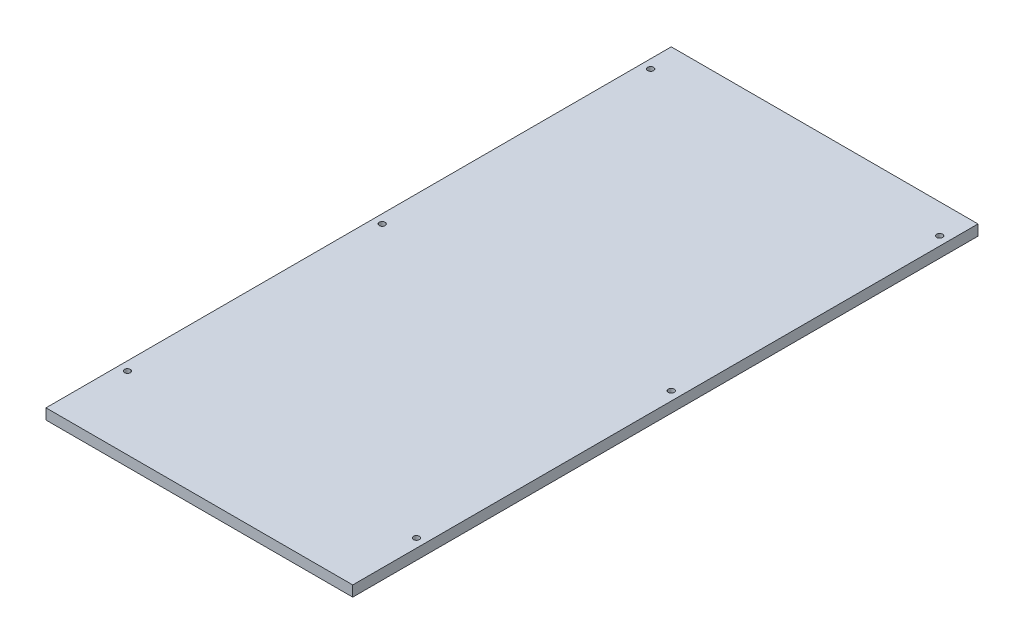
ISO-10303-21;
HEADER;
FILE_DESCRIPTION(('STEP AP214'),'2;1');
FILE_NAME('part.step','',(''),(''),'','','');
FILE_SCHEMA(('AUTOMOTIVE_DESIGN { 1 0 10303 214 1 1 1 1 }'));
ENDSEC;
DATA;
#1=APPLICATION_CONTEXT('core data for automotive mechanical design processes');
#2=APPLICATION_PROTOCOL_DEFINITION('international standard','automotive_design',2000,#1);
#3=PRODUCT_CONTEXT('',#1,'mechanical');
#4=PRODUCT('Part','Part','',(#3));
#5=PRODUCT_RELATED_PRODUCT_CATEGORY('part','',(#4));
#6=PRODUCT_DEFINITION_FORMATION('','',#4);
#7=PRODUCT_DEFINITION_CONTEXT('part definition',#1,'design');
#8=PRODUCT_DEFINITION('design','',#6,#7);
#9=PRODUCT_DEFINITION_SHAPE('','',#8);
#10=(LENGTH_UNIT() NAMED_UNIT(*) SI_UNIT(.MILLI.,.METRE.));
#11=(NAMED_UNIT(*) PLANE_ANGLE_UNIT() SI_UNIT($,.RADIAN.));
#12=(NAMED_UNIT(*) SI_UNIT($,.STERADIAN.) SOLID_ANGLE_UNIT());
#13=UNCERTAINTY_MEASURE_WITH_UNIT(LENGTH_MEASURE(1.E-05),#10,'distance_accuracy_value','');
#14=(GEOMETRIC_REPRESENTATION_CONTEXT(3) GLOBAL_UNCERTAINTY_ASSIGNED_CONTEXT((#13)) GLOBAL_UNIT_ASSIGNED_CONTEXT((#10,
#11,#12)) REPRESENTATION_CONTEXT('',''));
#15=CARTESIAN_POINT('',(0.,0.,0.));
#16=DIRECTION('',(0.,0.,1.));
#17=DIRECTION('',(1.,0.,0.));
#18=AXIS2_PLACEMENT_3D('',#15,#16,#17);
#19=CARTESIAN_POINT('',(-260.,18.,0.));
#20=DIRECTION('',(1.,0.,0.));
#21=DIRECTION('',(0.,0.,-1.));
#22=AXIS2_PLACEMENT_3D('',#19,#20,#21);
#23=PLANE('',#22);
#24=DIRECTION('',(0.,0.,1.));
#25=VECTOR('',#24,1.);
#26=CARTESIAN_POINT('',(-260.,0.,0.));
#27=LINE('',#26,#25);
#28=CARTESIAN_POINT('',(-260.,0.,0.));
#29=VERTEX_POINT('',#28);
#30=CARTESIAN_POINT('',(-260.,0.,1060.));
#31=VERTEX_POINT('',#30);
#32=EDGE_CURVE('E98',#29,#31,#27,.T.);
#33=ORIENTED_EDGE('',*,*,#32,.T.);
#34=DIRECTION('',(0.,-1.,0.));
#35=VECTOR('',#34,1.);
#36=CARTESIAN_POINT('',(-260.,18.,1060.));
#37=LINE('',#36,#35);
#38=CARTESIAN_POINT('',(-260.,18.,1060.));
#39=VERTEX_POINT('',#38);
#40=EDGE_CURVE('E11',#39,#31,#37,.T.);
#41=ORIENTED_EDGE('',*,*,#40,.F.);
#42=DIRECTION('',(0.,0.,1.));
#43=VECTOR('',#42,1.);
#44=CARTESIAN_POINT('',(-260.,18.,0.));
#45=LINE('',#44,#43);
#46=CARTESIAN_POINT('',(-260.,18.,0.));
#47=VERTEX_POINT('',#46);
#48=EDGE_CURVE('E86',#47,#39,#45,.T.);
#49=ORIENTED_EDGE('',*,*,#48,.F.);
#50=DIRECTION('',(0.,-1.,0.));
#51=VECTOR('',#50,1.);
#52=CARTESIAN_POINT('',(-260.,18.,0.));
#53=LINE('',#52,#51);
#54=EDGE_CURVE('E94',#47,#29,#53,.T.);
#55=ORIENTED_EDGE('',*,*,#54,.T.);
#56=EDGE_LOOP('',(#33,#41,#49,#55));
#57=FACE_BOUND('',#56,.T.);
#58=ADVANCED_FACE('F35',(#57),#23,.F.);
#59=CARTESIAN_POINT('',(-260.,18.,1060.));
#60=DIRECTION('',(0.,0.,-1.));
#61=DIRECTION('',(-1.,0.,0.));
#62=AXIS2_PLACEMENT_3D('',#59,#60,#61);
#63=PLANE('',#62);
#64=DIRECTION('',(1.,0.,0.));
#65=VECTOR('',#64,1.);
#66=CARTESIAN_POINT('',(-260.,0.,1060.));
#67=LINE('',#66,#65);
#68=CARTESIAN_POINT('',(260.,0.,1060.));
#69=VERTEX_POINT('',#68);
#70=EDGE_CURVE('E90',#31,#69,#67,.T.);
#71=ORIENTED_EDGE('',*,*,#70,.T.);
#72=DIRECTION('',(0.,-1.,0.));
#73=VECTOR('',#72,1.);
#74=CARTESIAN_POINT('',(260.,18.,1060.));
#75=LINE('',#74,#73);
#76=CARTESIAN_POINT('',(260.,18.,1060.));
#77=VERTEX_POINT('',#76);
#78=EDGE_CURVE('E43',#77,#69,#75,.T.);
#79=ORIENTED_EDGE('',*,*,#78,.F.);
#80=DIRECTION('',(1.,0.,0.));
#81=VECTOR('',#80,1.);
#82=CARTESIAN_POINT('',(-260.,18.,1060.));
#83=LINE('',#82,#81);
#84=EDGE_CURVE('E81',#39,#77,#83,.T.);
#85=ORIENTED_EDGE('',*,*,#84,.F.);
#86=ORIENTED_EDGE('',*,*,#40,.T.);
#87=EDGE_LOOP('',(#71,#79,#85,#86));
#88=FACE_BOUND('',#87,.T.);
#89=ADVANCED_FACE('F89',(#88),#63,.F.);
#90=CARTESIAN_POINT('',(260.,18.,0.));
#91=DIRECTION('',(-1.,0.,0.));
#92=DIRECTION('',(0.,0.,1.));
#93=AXIS2_PLACEMENT_3D('',#90,#91,#92);
#94=PLANE('',#93);
#95=DIRECTION('',(0.,0.,-1.));
#96=VECTOR('',#95,1.);
#97=CARTESIAN_POINT('',(260.,0.,0.));
#98=LINE('',#97,#96);
#99=CARTESIAN_POINT('',(260.,0.,0.));
#100=VERTEX_POINT('',#99);
#101=EDGE_CURVE('E68',#69,#100,#98,.T.);
#102=ORIENTED_EDGE('',*,*,#101,.T.);
#103=DIRECTION('',(0.,-1.,0.));
#104=VECTOR('',#103,1.);
#105=CARTESIAN_POINT('',(260.,18.,0.));
#106=LINE('',#105,#104);
#107=CARTESIAN_POINT('',(260.,18.,0.));
#108=VERTEX_POINT('',#107);
#109=EDGE_CURVE('E91',#108,#100,#106,.T.);
#110=ORIENTED_EDGE('',*,*,#109,.F.);
#111=DIRECTION('',(0.,0.,-1.));
#112=VECTOR('',#111,1.);
#113=CARTESIAN_POINT('',(260.,18.,0.));
#114=LINE('',#113,#112);
#115=EDGE_CURVE('E84',#77,#108,#114,.T.);
#116=ORIENTED_EDGE('',*,*,#115,.F.);
#117=ORIENTED_EDGE('',*,*,#78,.T.);
#118=EDGE_LOOP('',(#102,#110,#116,#117));
#119=FACE_BOUND('',#118,.T.);
#120=ADVANCED_FACE('F92',(#119),#94,.F.);
#121=CARTESIAN_POINT('',(-260.,18.,0.));
#122=DIRECTION('',(0.,0.,1.));
#123=DIRECTION('',(1.,0.,0.));
#124=AXIS2_PLACEMENT_3D('',#121,#122,#123);
#125=PLANE('',#124);
#126=DIRECTION('',(-1.,0.,0.));
#127=VECTOR('',#126,1.);
#128=CARTESIAN_POINT('',(-260.,0.,0.));
#129=LINE('',#128,#127);
#130=EDGE_CURVE('E74',#100,#29,#129,.T.);
#131=ORIENTED_EDGE('',*,*,#130,.T.);
#132=ORIENTED_EDGE('',*,*,#54,.F.);
#133=DIRECTION('',(-1.,0.,0.));
#134=VECTOR('',#133,1.);
#135=CARTESIAN_POINT('',(-260.,18.,0.));
#136=LINE('',#135,#134);
#137=EDGE_CURVE('E51',#108,#47,#136,.T.);
#138=ORIENTED_EDGE('',*,*,#137,.F.);
#139=ORIENTED_EDGE('',*,*,#109,.T.);
#140=EDGE_LOOP('',(#131,#132,#138,#139));
#141=FACE_BOUND('',#140,.T.);
#142=ADVANCED_FACE('F106',(#141),#125,.F.);
#143=CARTESIAN_POINT('',(0.,18.,0.));
#144=DIRECTION('',(0.,1.,0.));
#145=DIRECTION('',(0.,0.,1.));
#146=AXIS2_PLACEMENT_3D('',#143,#144,#145);
#147=PLANE('',#146);
#148=CARTESIAN_POINT('',(-245.,18.,505.));
#149=DIRECTION('',(0.,1.,0.));
#150=DIRECTION('',(0.,0.,-1.));
#151=AXIS2_PLACEMENT_3D('',#148,#149,#150);
#152=CIRCLE('',#151,4.99999999999999);
#153=CARTESIAN_POINT('',(-245.,18.,500.));
#154=VERTEX_POINT('',#153);
#155=EDGE_CURVE('E142',#154,#154,#152,.T.);
#156=ORIENTED_EDGE('',*,*,#155,.F.);
#157=EDGE_LOOP('',(#156));
#158=FACE_BOUND('',#157,.T.);
#159=CARTESIAN_POINT('',(-245.,18.,937.));
#160=DIRECTION('',(0.,1.,0.));
#161=DIRECTION('',(0.,0.,-1.));
#162=AXIS2_PLACEMENT_3D('',#159,#160,#161);
#163=CIRCLE('',#162,4.99999999999999);
#164=CARTESIAN_POINT('',(-245.,18.,932.));
#165=VERTEX_POINT('',#164);
#166=EDGE_CURVE('E136',#165,#165,#163,.T.);
#167=ORIENTED_EDGE('',*,*,#166,.F.);
#168=EDGE_LOOP('',(#167));
#169=FACE_BOUND('',#168,.T.);
#170=CARTESIAN_POINT('',(245.,18.,937.));
#171=DIRECTION('',(0.,1.,0.));
#172=DIRECTION('',(0.,0.,1.));
#173=AXIS2_PLACEMENT_3D('',#170,#171,#172);
#174=CIRCLE('',#173,4.99999999999999);
#175=CARTESIAN_POINT('',(245.,18.,942.));
#176=VERTEX_POINT('',#175);
#177=EDGE_CURVE('E130',#176,#176,#174,.T.);
#178=ORIENTED_EDGE('',*,*,#177,.F.);
#179=EDGE_LOOP('',(#178));
#180=FACE_BOUND('',#179,.T.);
#181=CARTESIAN_POINT('',(245.,18.,505.));
#182=DIRECTION('',(0.,1.,0.));
#183=DIRECTION('',(0.,0.,1.));
#184=AXIS2_PLACEMENT_3D('',#181,#182,#183);
#185=CIRCLE('',#184,4.99999999999999);
#186=CARTESIAN_POINT('',(245.,18.,510.));
#187=VERTEX_POINT('',#186);
#188=EDGE_CURVE('E124',#187,#187,#185,.T.);
#189=ORIENTED_EDGE('',*,*,#188,.F.);
#190=EDGE_LOOP('',(#189));
#191=FACE_BOUND('',#190,.T.);
#192=CARTESIAN_POINT('',(-245.,18.,50.));
#193=DIRECTION('',(0.,1.,0.));
#194=DIRECTION('',(0.,0.,-1.));
#195=AXIS2_PLACEMENT_3D('',#192,#193,#194);
#196=CIRCLE('',#195,4.99999999999999);
#197=CARTESIAN_POINT('',(-245.,18.,45.0000000000001));
#198=VERTEX_POINT('',#197);
#199=EDGE_CURVE('E118',#198,#198,#196,.T.);
#200=ORIENTED_EDGE('',*,*,#199,.F.);
#201=EDGE_LOOP('',(#200));
#202=FACE_BOUND('',#201,.T.);
#203=CARTESIAN_POINT('',(245.,18.,50.));
#204=DIRECTION('',(0.,1.,0.));
#205=DIRECTION('',(0.,0.,1.));
#206=AXIS2_PLACEMENT_3D('',#203,#204,#205);
#207=CIRCLE('',#206,4.99999999999999);
#208=CARTESIAN_POINT('',(245.,18.,55.));
#209=VERTEX_POINT('',#208);
#210=EDGE_CURVE('E112',#209,#209,#207,.T.);
#211=ORIENTED_EDGE('',*,*,#210,.F.);
#212=EDGE_LOOP('',(#211));
#213=FACE_BOUND('',#212,.T.);
#214=ORIENTED_EDGE('',*,*,#48,.T.);
#215=ORIENTED_EDGE('',*,*,#84,.T.);
#216=ORIENTED_EDGE('',*,*,#115,.T.);
#217=ORIENTED_EDGE('',*,*,#137,.T.);
#218=EDGE_LOOP('',(#214,#215,#216,#217));
#219=FACE_BOUND('',#218,.T.);
#220=ADVANCED_FACE('F82',(#158,#169,#180,#191,#202,#213,#219),#147,.T.);
#221=CARTESIAN_POINT('',(0.,0.,0.));
#222=DIRECTION('',(0.,1.,0.));
#223=DIRECTION('',(0.,0.,1.));
#224=AXIS2_PLACEMENT_3D('',#221,#222,#223);
#225=PLANE('',#224);
#226=CARTESIAN_POINT('',(-245.,0.,505.));
#227=DIRECTION('',(0.,1.,0.));
#228=DIRECTION('',(0.,0.,-1.));
#229=AXIS2_PLACEMENT_3D('',#226,#227,#228);
#230=CIRCLE('',#229,4.99999999999999);
#231=CARTESIAN_POINT('',(-245.,0.,500.));
#232=VERTEX_POINT('',#231);
#233=EDGE_CURVE('E139',#232,#232,#230,.T.);
#234=ORIENTED_EDGE('',*,*,#233,.T.);
#235=EDGE_LOOP('',(#234));
#236=FACE_BOUND('',#235,.T.);
#237=CARTESIAN_POINT('',(-245.,0.,937.));
#238=DIRECTION('',(0.,1.,0.));
#239=DIRECTION('',(0.,0.,-1.));
#240=AXIS2_PLACEMENT_3D('',#237,#238,#239);
#241=CIRCLE('',#240,4.99999999999999);
#242=CARTESIAN_POINT('',(-245.,0.,932.));
#243=VERTEX_POINT('',#242);
#244=EDGE_CURVE('E133',#243,#243,#241,.T.);
#245=ORIENTED_EDGE('',*,*,#244,.T.);
#246=EDGE_LOOP('',(#245));
#247=FACE_BOUND('',#246,.T.);
#248=CARTESIAN_POINT('',(245.,0.,937.));
#249=DIRECTION('',(0.,1.,0.));
#250=DIRECTION('',(0.,0.,1.));
#251=AXIS2_PLACEMENT_3D('',#248,#249,#250);
#252=CIRCLE('',#251,4.99999999999999);
#253=CARTESIAN_POINT('',(245.,0.,942.));
#254=VERTEX_POINT('',#253);
#255=EDGE_CURVE('E127',#254,#254,#252,.T.);
#256=ORIENTED_EDGE('',*,*,#255,.T.);
#257=EDGE_LOOP('',(#256));
#258=FACE_BOUND('',#257,.T.);
#259=CARTESIAN_POINT('',(245.,0.,505.));
#260=DIRECTION('',(0.,1.,0.));
#261=DIRECTION('',(0.,0.,1.));
#262=AXIS2_PLACEMENT_3D('',#259,#260,#261);
#263=CIRCLE('',#262,4.99999999999999);
#264=CARTESIAN_POINT('',(245.,0.,510.));
#265=VERTEX_POINT('',#264);
#266=EDGE_CURVE('E121',#265,#265,#263,.T.);
#267=ORIENTED_EDGE('',*,*,#266,.T.);
#268=EDGE_LOOP('',(#267));
#269=FACE_BOUND('',#268,.T.);
#270=CARTESIAN_POINT('',(-245.,0.,50.));
#271=DIRECTION('',(0.,1.,0.));
#272=DIRECTION('',(0.,0.,-1.));
#273=AXIS2_PLACEMENT_3D('',#270,#271,#272);
#274=CIRCLE('',#273,4.99999999999999);
#275=CARTESIAN_POINT('',(-245.,0.,45.0000000000001));
#276=VERTEX_POINT('',#275);
#277=EDGE_CURVE('E115',#276,#276,#274,.T.);
#278=ORIENTED_EDGE('',*,*,#277,.T.);
#279=EDGE_LOOP('',(#278));
#280=FACE_BOUND('',#279,.T.);
#281=CARTESIAN_POINT('',(245.,0.,50.));
#282=DIRECTION('',(0.,1.,0.));
#283=DIRECTION('',(0.,0.,1.));
#284=AXIS2_PLACEMENT_3D('',#281,#282,#283);
#285=CIRCLE('',#284,4.99999999999999);
#286=CARTESIAN_POINT('',(245.,0.,55.));
#287=VERTEX_POINT('',#286);
#288=EDGE_CURVE('E101',#287,#287,#285,.T.);
#289=ORIENTED_EDGE('',*,*,#288,.T.);
#290=EDGE_LOOP('',(#289));
#291=FACE_BOUND('',#290,.T.);
#292=ORIENTED_EDGE('',*,*,#32,.F.);
#293=ORIENTED_EDGE('',*,*,#130,.F.);
#294=ORIENTED_EDGE('',*,*,#101,.F.);
#295=ORIENTED_EDGE('',*,*,#70,.F.);
#296=EDGE_LOOP('',(#292,#293,#294,#295));
#297=FACE_BOUND('',#296,.T.);
#298=ADVANCED_FACE('F109',(#236,#247,#258,#269,#280,#291,#297),#225,.F.);
#299=CARTESIAN_POINT('',(245.,0.,50.));
#300=DIRECTION('',(0.,1.,0.));
#301=DIRECTION('',(0.,0.,1.));
#302=AXIS2_PLACEMENT_3D('',#299,#300,#301);
#303=CYLINDRICAL_SURFACE('',#302,4.99999999999999);
#304=ORIENTED_EDGE('',*,*,#288,.F.);
#305=EDGE_LOOP('',(#304));
#306=FACE_BOUND('',#305,.T.);
#307=ORIENTED_EDGE('',*,*,#210,.T.);
#308=EDGE_LOOP('',(#307));
#309=FACE_BOUND('',#308,.T.);
#310=ADVANCED_FACE('F170',(#306,#309),#303,.F.);
#311=CARTESIAN_POINT('',(-245.,0.,50.));
#312=DIRECTION('',(0.,1.,0.));
#313=DIRECTION('',(0.,0.,1.));
#314=AXIS2_PLACEMENT_3D('',#311,#312,#313);
#315=CYLINDRICAL_SURFACE('',#314,4.99999999999999);
#316=ORIENTED_EDGE('',*,*,#277,.F.);
#317=EDGE_LOOP('',(#316));
#318=FACE_BOUND('',#317,.T.);
#319=ORIENTED_EDGE('',*,*,#199,.T.);
#320=EDGE_LOOP('',(#319));
#321=FACE_BOUND('',#320,.T.);
#322=ADVANCED_FACE('F172',(#318,#321),#315,.F.);
#323=CARTESIAN_POINT('',(245.,0.,505.));
#324=DIRECTION('',(0.,1.,0.));
#325=DIRECTION('',(0.,0.,1.));
#326=AXIS2_PLACEMENT_3D('',#323,#324,#325);
#327=CYLINDRICAL_SURFACE('',#326,4.99999999999999);
#328=ORIENTED_EDGE('',*,*,#266,.F.);
#329=EDGE_LOOP('',(#328));
#330=FACE_BOUND('',#329,.T.);
#331=ORIENTED_EDGE('',*,*,#188,.T.);
#332=EDGE_LOOP('',(#331));
#333=FACE_BOUND('',#332,.T.);
#334=ADVANCED_FACE('F179',(#330,#333),#327,.F.);
#335=CARTESIAN_POINT('',(245.,0.,937.));
#336=DIRECTION('',(0.,1.,0.));
#337=DIRECTION('',(0.,0.,1.));
#338=AXIS2_PLACEMENT_3D('',#335,#336,#337);
#339=CYLINDRICAL_SURFACE('',#338,4.99999999999999);
#340=ORIENTED_EDGE('',*,*,#255,.F.);
#341=EDGE_LOOP('',(#340));
#342=FACE_BOUND('',#341,.T.);
#343=ORIENTED_EDGE('',*,*,#177,.T.);
#344=EDGE_LOOP('',(#343));
#345=FACE_BOUND('',#344,.T.);
#346=ADVANCED_FACE('F225',(#342,#345),#339,.F.);
#347=CARTESIAN_POINT('',(-245.,0.,937.));
#348=DIRECTION('',(0.,1.,0.));
#349=DIRECTION('',(0.,0.,1.));
#350=AXIS2_PLACEMENT_3D('',#347,#348,#349);
#351=CYLINDRICAL_SURFACE('',#350,4.99999999999999);
#352=ORIENTED_EDGE('',*,*,#244,.F.);
#353=EDGE_LOOP('',(#352));
#354=FACE_BOUND('',#353,.T.);
#355=ORIENTED_EDGE('',*,*,#166,.T.);
#356=EDGE_LOOP('',(#355));
#357=FACE_BOUND('',#356,.T.);
#358=ADVANCED_FACE('F153',(#354,#357),#351,.F.);
#359=CARTESIAN_POINT('',(-245.,0.,505.));
#360=DIRECTION('',(0.,1.,0.));
#361=DIRECTION('',(0.,0.,1.));
#362=AXIS2_PLACEMENT_3D('',#359,#360,#361);
#363=CYLINDRICAL_SURFACE('',#362,4.99999999999999);
#364=ORIENTED_EDGE('',*,*,#233,.F.);
#365=EDGE_LOOP('',(#364));
#366=FACE_BOUND('',#365,.T.);
#367=ORIENTED_EDGE('',*,*,#155,.T.);
#368=EDGE_LOOP('',(#367));
#369=FACE_BOUND('',#368,.T.);
#370=ADVANCED_FACE('F150',(#366,#369),#363,.F.);
#371=CLOSED_SHELL('',(#58,#89,#120,#142,#220,#298,#310,#322,#334,#346,#358,#370));
#372=MANIFOLD_SOLID_BREP('B2',#371);
#373=ADVANCED_BREP_SHAPE_REPRESENTATION('',(#18,#372),#14);
#374=SHAPE_DEFINITION_REPRESENTATION(#9,#373);
ENDSEC;
END-ISO-10303-21;
